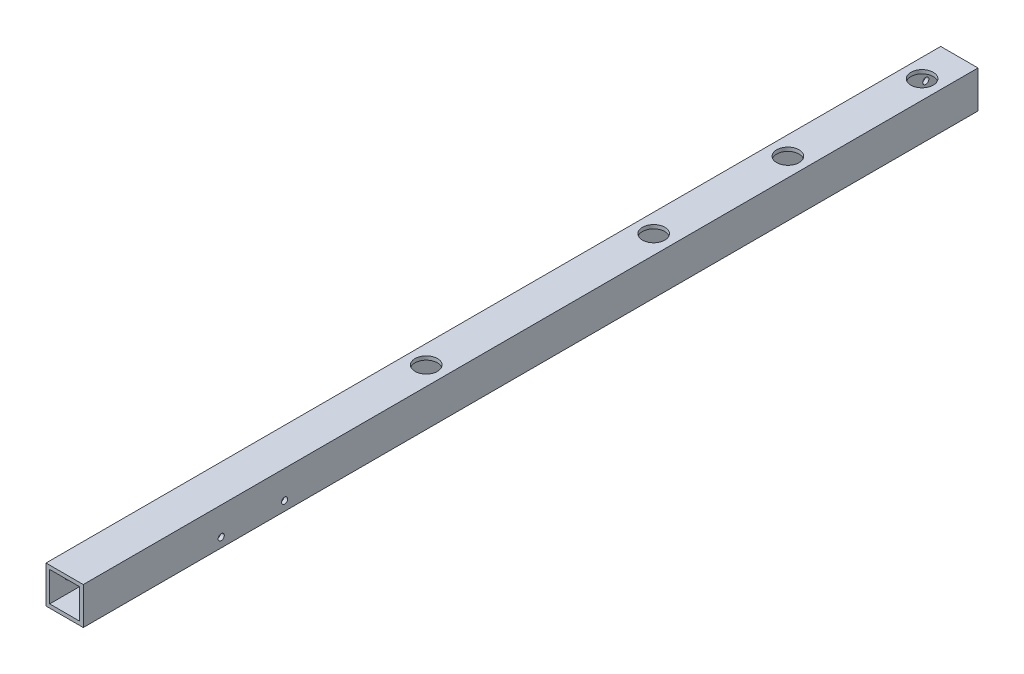
ISO-10303-21;
HEADER;
FILE_DESCRIPTION(('STEP AP214'),'2;1');
FILE_NAME('part.step','',(''),(''),'','','');
FILE_SCHEMA(('AUTOMOTIVE_DESIGN { 1 0 10303 214 1 1 1 1 }'));
ENDSEC;
DATA;
#1=APPLICATION_CONTEXT('core data for automotive mechanical design processes');
#2=APPLICATION_PROTOCOL_DEFINITION('international standard','automotive_design',2000,#1);
#3=PRODUCT_CONTEXT('',#1,'mechanical');
#4=PRODUCT('Part','Part','',(#3));
#5=PRODUCT_RELATED_PRODUCT_CATEGORY('part','',(#4));
#6=PRODUCT_DEFINITION_FORMATION('','',#4);
#7=PRODUCT_DEFINITION_CONTEXT('part definition',#1,'design');
#8=PRODUCT_DEFINITION('design','',#6,#7);
#9=PRODUCT_DEFINITION_SHAPE('','',#8);
#10=(LENGTH_UNIT() NAMED_UNIT(*) SI_UNIT(.MILLI.,.METRE.));
#11=(NAMED_UNIT(*) PLANE_ANGLE_UNIT() SI_UNIT($,.RADIAN.));
#12=(NAMED_UNIT(*) SI_UNIT($,.STERADIAN.) SOLID_ANGLE_UNIT());
#13=UNCERTAINTY_MEASURE_WITH_UNIT(LENGTH_MEASURE(1.E-05),#10,'distance_accuracy_value','');
#14=(GEOMETRIC_REPRESENTATION_CONTEXT(3) GLOBAL_UNCERTAINTY_ASSIGNED_CONTEXT((#13)) GLOBAL_UNIT_ASSIGNED_CONTEXT((#10,
#11,#12)) REPRESENTATION_CONTEXT('',''));
#15=CARTESIAN_POINT('',(0.,0.,0.));
#16=DIRECTION('',(0.,0.,1.));
#17=DIRECTION('',(1.,0.,0.));
#18=AXIS2_PLACEMENT_3D('',#15,#16,#17);
#19=CARTESIAN_POINT('',(10.,10.,560.));
#20=DIRECTION('',(-1.,0.,0.));
#21=DIRECTION('',(0.,0.,1.));
#22=AXIS2_PLACEMENT_3D('',#19,#20,#21);
#23=PLANE('',#22);
#24=CARTESIAN_POINT('',(10.,-5.,446.));
#25=DIRECTION('',(1.,0.,0.));
#26=DIRECTION('',(0.,0.,-1.));
#27=AXIS2_PLACEMENT_3D('',#24,#25,#26);
#28=CIRCLE('',#27,1.64999999999999);
#29=CARTESIAN_POINT('',(10.,-5.,444.35));
#30=VERTEX_POINT('',#29);
#31=EDGE_CURVE('E185',#30,#30,#28,.T.);
#32=ORIENTED_EDGE('',*,*,#31,.F.);
#33=EDGE_LOOP('',(#32));
#34=FACE_BOUND('',#33,.T.);
#35=DIRECTION('',(0.,0.,-1.));
#36=VECTOR('',#35,1.);
#37=CARTESIAN_POINT('',(10.,10.,560.));
#38=LINE('',#37,#36);
#39=CARTESIAN_POINT('',(10.,10.,520.));
#40=VERTEX_POINT('',#39);
#41=CARTESIAN_POINT('',(10.,10.,40.));
#42=VERTEX_POINT('',#41);
#43=EDGE_CURVE('E132',#40,#42,#38,.T.);
#44=ORIENTED_EDGE('',*,*,#43,.F.);
#45=DIRECTION('',(0.,-1.,0.));
#46=VECTOR('',#45,1.);
#47=CARTESIAN_POINT('',(10.,10.,520.));
#48=LINE('',#47,#46);
#49=CARTESIAN_POINT('',(10.,-10.,520.));
#50=VERTEX_POINT('',#49);
#51=EDGE_CURVE('E226',#40,#50,#48,.T.);
#52=ORIENTED_EDGE('',*,*,#51,.T.);
#53=DIRECTION('',(0.,0.,-1.));
#54=VECTOR('',#53,1.);
#55=CARTESIAN_POINT('',(10.,-10.,560.));
#56=LINE('',#55,#54);
#57=CARTESIAN_POINT('',(10.,-10.,40.));
#58=VERTEX_POINT('',#57);
#59=EDGE_CURVE('E126',#50,#58,#56,.T.);
#60=ORIENTED_EDGE('',*,*,#59,.T.);
#61=DIRECTION('',(0.,-1.,0.));
#62=VECTOR('',#61,1.);
#63=CARTESIAN_POINT('',(10.,10.,40.));
#64=LINE('',#63,#62);
#65=EDGE_CURVE('E121',#42,#58,#64,.T.);
#66=ORIENTED_EDGE('',*,*,#65,.F.);
#67=EDGE_LOOP('',(#44,#52,#60,#66));
#68=FACE_BOUND('',#67,.T.);
#69=CARTESIAN_POINT('',(10.,-5.,412.));
#70=DIRECTION('',(1.,0.,0.));
#71=DIRECTION('',(0.,0.,-1.));
#72=AXIS2_PLACEMENT_3D('',#69,#70,#71);
#73=CIRCLE('',#72,1.64999999999999);
#74=CARTESIAN_POINT('',(10.,-5.,410.35));
#75=VERTEX_POINT('',#74);
#76=EDGE_CURVE('E175',#75,#75,#73,.T.);
#77=ORIENTED_EDGE('',*,*,#76,.F.);
#78=EDGE_LOOP('',(#77));
#79=FACE_BOUND('',#78,.T.);
#80=ADVANCED_FACE('F35',(#34,#68,#79),#23,.F.);
#81=CARTESIAN_POINT('',(-10.,10.,560.));
#82=DIRECTION('',(1.,0.,0.));
#83=DIRECTION('',(0.,1.,0.));
#84=AXIS2_PLACEMENT_3D('',#81,#82,#83);
#85=PLANE('',#84);
#86=CARTESIAN_POINT('',(-10.,0.,490.));
#87=DIRECTION('',(1.,0.,0.));
#88=DIRECTION('',(0.,1.,0.));
#89=AXIS2_PLACEMENT_3D('',#86,#87,#88);
#90=CIRCLE('',#89,1.64999999999999);
#91=CARTESIAN_POINT('',(-10.,1.64999999999999,490.));
#92=VERTEX_POINT('',#91);
#93=EDGE_CURVE('E169',#92,#92,#90,.T.);
#94=ORIENTED_EDGE('',*,*,#93,.T.);
#95=EDGE_LOOP('',(#94));
#96=FACE_BOUND('',#95,.T.);
#97=DIRECTION('',(0.,0.,-1.));
#98=VECTOR('',#97,1.);
#99=CARTESIAN_POINT('',(-10.,-10.,560.));
#100=LINE('',#99,#98);
#101=CARTESIAN_POINT('',(-10.,-10.,520.));
#102=VERTEX_POINT('',#101);
#103=CARTESIAN_POINT('',(-10.,-10.,40.));
#104=VERTEX_POINT('',#103);
#105=EDGE_CURVE('E128',#102,#104,#100,.T.);
#106=ORIENTED_EDGE('',*,*,#105,.F.);
#107=DIRECTION('',(0.,1.,0.));
#108=VECTOR('',#107,1.);
#109=CARTESIAN_POINT('',(-10.,10.,520.));
#110=LINE('',#109,#108);
#111=CARTESIAN_POINT('',(-10.,10.,520.));
#112=VERTEX_POINT('',#111);
#113=EDGE_CURVE('E51',#102,#112,#110,.T.);
#114=ORIENTED_EDGE('',*,*,#113,.T.);
#115=DIRECTION('',(0.,0.,-1.));
#116=VECTOR('',#115,1.);
#117=CARTESIAN_POINT('',(-10.,10.,560.));
#118=LINE('',#117,#116);
#119=CARTESIAN_POINT('',(-10.,10.,40.));
#120=VERTEX_POINT('',#119);
#121=EDGE_CURVE('E130',#112,#120,#118,.T.);
#122=ORIENTED_EDGE('',*,*,#121,.T.);
#123=DIRECTION('',(0.,1.,0.));
#124=VECTOR('',#123,1.);
#125=CARTESIAN_POINT('',(-10.,10.,40.));
#126=LINE('',#125,#124);
#127=EDGE_CURVE('E240',#104,#120,#126,.T.);
#128=ORIENTED_EDGE('',*,*,#127,.F.);
#129=EDGE_LOOP('',(#106,#114,#122,#128));
#130=FACE_BOUND('',#129,.T.);
#131=CARTESIAN_POINT('',(-10.,0.,50.));
#132=DIRECTION('',(-1.,0.,0.));
#133=DIRECTION('',(0.,0.,1.));
#134=AXIS2_PLACEMENT_3D('',#131,#132,#133);
#135=CIRCLE('',#134,1.64999999999999);
#136=CARTESIAN_POINT('',(-10.,0.,51.65));
#137=VERTEX_POINT('',#136);
#138=EDGE_CURVE('E167',#137,#137,#135,.T.);
#139=ORIENTED_EDGE('',*,*,#138,.F.);
#140=EDGE_LOOP('',(#139));
#141=FACE_BOUND('',#140,.T.);
#142=CARTESIAN_POINT('',(-10.,0.,70.));
#143=DIRECTION('',(-1.,0.,0.));
#144=DIRECTION('',(0.,0.,1.));
#145=AXIS2_PLACEMENT_3D('',#142,#143,#144);
#146=CIRCLE('',#145,1.64999999999999);
#147=CARTESIAN_POINT('',(-10.,0.,71.65));
#148=VERTEX_POINT('',#147);
#149=EDGE_CURVE('E168',#148,#148,#146,.T.);
#150=ORIENTED_EDGE('',*,*,#149,.F.);
#151=EDGE_LOOP('',(#150));
#152=FACE_BOUND('',#151,.T.);
#153=CARTESIAN_POINT('',(-10.,0.,510.));
#154=DIRECTION('',(-1.,0.,0.));
#155=DIRECTION('',(0.,0.,1.));
#156=AXIS2_PLACEMENT_3D('',#153,#154,#155);
#157=CIRCLE('',#156,1.64999999999999);
#158=CARTESIAN_POINT('',(-10.,0.,511.65));
#159=VERTEX_POINT('',#158);
#160=EDGE_CURVE('E171',#159,#159,#157,.T.);
#161=ORIENTED_EDGE('',*,*,#160,.F.);
#162=EDGE_LOOP('',(#161));
#163=FACE_BOUND('',#162,.T.);
#164=ADVANCED_FACE('F259',(#96,#130,#141,#152,#163),#85,.F.);
#165=CARTESIAN_POINT('',(-10.,10.,560.));
#166=DIRECTION('',(0.,-1.,0.));
#167=DIRECTION('',(1.,0.,0.));
#168=AXIS2_PLACEMENT_3D('',#165,#166,#167);
#169=PLANE('',#168);
#170=CARTESIAN_POINT('',(0.,10.,326.));
#171=DIRECTION('',(0.,1.,0.));
#172=DIRECTION('',(-1.,0.,0.));
#173=AXIS2_PLACEMENT_3D('',#170,#171,#172);
#174=CIRCLE('',#173,6.);
#175=CARTESIAN_POINT('',(-6.,10.,326.));
#176=VERTEX_POINT('',#175);
#177=EDGE_CURVE('E163',#176,#176,#174,.T.);
#178=ORIENTED_EDGE('',*,*,#177,.F.);
#179=EDGE_LOOP('',(#178));
#180=FACE_BOUND('',#179,.T.);
#181=CARTESIAN_POINT('',(0.,10.,60.));
#182=DIRECTION('',(0.,1.,0.));
#183=DIRECTION('',(-1.,0.,0.));
#184=AXIS2_PLACEMENT_3D('',#181,#182,#183);
#185=CIRCLE('',#184,6.);
#186=CARTESIAN_POINT('',(-6.,10.,60.));
#187=VERTEX_POINT('',#186);
#188=EDGE_CURVE('E148',#187,#187,#185,.T.);
#189=ORIENTED_EDGE('',*,*,#188,.F.);
#190=EDGE_LOOP('',(#189));
#191=FACE_BOUND('',#190,.T.);
#192=CARTESIAN_POINT('',(0.,10.,132.));
#193=DIRECTION('',(0.,1.,0.));
#194=DIRECTION('',(-1.,0.,0.));
#195=AXIS2_PLACEMENT_3D('',#192,#193,#194);
#196=CIRCLE('',#195,6.);
#197=CARTESIAN_POINT('',(-5.99999999999999,10.,132.));
#198=VERTEX_POINT('',#197);
#199=EDGE_CURVE('E206',#198,#198,#196,.T.);
#200=ORIENTED_EDGE('',*,*,#199,.F.);
#201=EDGE_LOOP('',(#200));
#202=FACE_BOUND('',#201,.T.);
#203=CARTESIAN_POINT('',(0.,10.,204.));
#204=DIRECTION('',(0.,1.,0.));
#205=DIRECTION('',(-1.,0.,0.));
#206=AXIS2_PLACEMENT_3D('',#203,#204,#205);
#207=CIRCLE('',#206,6.);
#208=CARTESIAN_POINT('',(-5.99999999999999,10.,204.));
#209=VERTEX_POINT('',#208);
#210=EDGE_CURVE('E158',#209,#209,#207,.T.);
#211=ORIENTED_EDGE('',*,*,#210,.F.);
#212=EDGE_LOOP('',(#211));
#213=FACE_BOUND('',#212,.T.);
#214=ORIENTED_EDGE('',*,*,#121,.F.);
#215=DIRECTION('',(1.,0.,0.));
#216=VECTOR('',#215,1.);
#217=CARTESIAN_POINT('',(-10.,10.,520.));
#218=LINE('',#217,#216);
#219=EDGE_CURVE('E223',#112,#40,#218,.T.);
#220=ORIENTED_EDGE('',*,*,#219,.T.);
#221=ORIENTED_EDGE('',*,*,#43,.T.);
#222=DIRECTION('',(1.,0.,0.));
#223=VECTOR('',#222,1.);
#224=CARTESIAN_POINT('',(-10.,10.,40.));
#225=LINE('',#224,#223);
#226=EDGE_CURVE('E243',#120,#42,#225,.T.);
#227=ORIENTED_EDGE('',*,*,#226,.F.);
#228=EDGE_LOOP('',(#214,#220,#221,#227));
#229=FACE_BOUND('',#228,.T.);
#230=ADVANCED_FACE('F263',(#180,#191,#202,#213,#229),#169,.F.);
#231=CARTESIAN_POINT('',(-10.,-10.,560.));
#232=DIRECTION('',(0.,1.,0.));
#233=DIRECTION('',(0.,0.,1.));
#234=AXIS2_PLACEMENT_3D('',#231,#232,#233);
#235=PLANE('',#234);
#236=CARTESIAN_POINT('',(0.,-10.,326.));
#237=DIRECTION('',(0.,1.,0.));
#238=DIRECTION('',(-1.,0.,0.));
#239=AXIS2_PLACEMENT_3D('',#236,#237,#238);
#240=CIRCLE('',#239,2.1);
#241=CARTESIAN_POINT('',(-2.1,-10.,326.));
#242=VERTEX_POINT('',#241);
#243=EDGE_CURVE('E159',#242,#242,#240,.T.);
#244=ORIENTED_EDGE('',*,*,#243,.T.);
#245=EDGE_LOOP('',(#244));
#246=FACE_BOUND('',#245,.T.);
#247=CARTESIAN_POINT('',(0.,-10.,60.));
#248=DIRECTION('',(0.,1.,0.));
#249=DIRECTION('',(-1.,0.,0.));
#250=AXIS2_PLACEMENT_3D('',#247,#248,#249);
#251=CIRCLE('',#250,2.1);
#252=CARTESIAN_POINT('',(-2.1,-10.,60.));
#253=VERTEX_POINT('',#252);
#254=EDGE_CURVE('E139',#253,#253,#251,.T.);
#255=ORIENTED_EDGE('',*,*,#254,.T.);
#256=EDGE_LOOP('',(#255));
#257=FACE_BOUND('',#256,.T.);
#258=CARTESIAN_POINT('',(0.,-10.,132.));
#259=DIRECTION('',(0.,1.,0.));
#260=DIRECTION('',(-1.,0.,0.));
#261=AXIS2_PLACEMENT_3D('',#258,#259,#260);
#262=CIRCLE('',#261,2.1);
#263=CARTESIAN_POINT('',(-2.09999999999999,-10.,132.));
#264=VERTEX_POINT('',#263);
#265=EDGE_CURVE('E213',#264,#264,#262,.T.);
#266=ORIENTED_EDGE('',*,*,#265,.T.);
#267=EDGE_LOOP('',(#266));
#268=FACE_BOUND('',#267,.T.);
#269=CARTESIAN_POINT('',(0.,-10.,204.));
#270=DIRECTION('',(0.,1.,0.));
#271=DIRECTION('',(-1.,0.,0.));
#272=AXIS2_PLACEMENT_3D('',#269,#270,#271);
#273=CIRCLE('',#272,2.1);
#274=CARTESIAN_POINT('',(-2.09999999999999,-10.,204.));
#275=VERTEX_POINT('',#274);
#276=EDGE_CURVE('E154',#275,#275,#273,.T.);
#277=ORIENTED_EDGE('',*,*,#276,.T.);
#278=EDGE_LOOP('',(#277));
#279=FACE_BOUND('',#278,.T.);
#280=ORIENTED_EDGE('',*,*,#59,.F.);
#281=DIRECTION('',(-1.,0.,0.));
#282=VECTOR('',#281,1.);
#283=CARTESIAN_POINT('',(-10.,-10.,520.));
#284=LINE('',#283,#282);
#285=EDGE_CURVE('E220',#50,#102,#284,.T.);
#286=ORIENTED_EDGE('',*,*,#285,.T.);
#287=ORIENTED_EDGE('',*,*,#105,.T.);
#288=DIRECTION('',(-1.,0.,0.));
#289=VECTOR('',#288,1.);
#290=CARTESIAN_POINT('',(-10.,-10.,40.));
#291=LINE('',#290,#289);
#292=EDGE_CURVE('E237',#58,#104,#291,.T.);
#293=ORIENTED_EDGE('',*,*,#292,.F.);
#294=EDGE_LOOP('',(#280,#286,#287,#293));
#295=FACE_BOUND('',#294,.T.);
#296=ADVANCED_FACE('F256',(#246,#257,#268,#279,#295),#235,.F.);
#297=CARTESIAN_POINT('',(8.,8.,560.));
#298=DIRECTION('',(-1.,0.,0.));
#299=DIRECTION('',(0.,0.,1.));
#300=AXIS2_PLACEMENT_3D('',#297,#298,#299);
#301=PLANE('',#300);
#302=CARTESIAN_POINT('',(8.,-5.,446.));
#303=DIRECTION('',(-1.,0.,0.));
#304=DIRECTION('',(0.,0.,1.));
#305=AXIS2_PLACEMENT_3D('',#302,#303,#304);
#306=CIRCLE('',#305,1.64999999999999);
#307=CARTESIAN_POINT('',(8.,-5.,447.65));
#308=VERTEX_POINT('',#307);
#309=EDGE_CURVE('E38',#308,#308,#306,.T.);
#310=ORIENTED_EDGE('',*,*,#309,.F.);
#311=EDGE_LOOP('',(#310));
#312=FACE_BOUND('',#311,.T.);
#313=CARTESIAN_POINT('',(8.,-5.,412.));
#314=DIRECTION('',(-1.,0.,0.));
#315=DIRECTION('',(0.,0.,1.));
#316=AXIS2_PLACEMENT_3D('',#313,#314,#315);
#317=CIRCLE('',#316,1.64999999999999);
#318=CARTESIAN_POINT('',(8.,-5.,413.65));
#319=VERTEX_POINT('',#318);
#320=EDGE_CURVE('E173',#319,#319,#317,.T.);
#321=ORIENTED_EDGE('',*,*,#320,.F.);
#322=EDGE_LOOP('',(#321));
#323=FACE_BOUND('',#322,.T.);
#324=DIRECTION('',(0.,-1.,0.));
#325=VECTOR('',#324,1.);
#326=CARTESIAN_POINT('',(8.,8.,520.));
#327=LINE('',#326,#325);
#328=CARTESIAN_POINT('',(8.,8.,520.));
#329=VERTEX_POINT('',#328);
#330=CARTESIAN_POINT('',(8.,-8.,520.));
#331=VERTEX_POINT('',#330);
#332=EDGE_CURVE('E58',#329,#331,#327,.T.);
#333=ORIENTED_EDGE('',*,*,#332,.F.);
#334=DIRECTION('',(0.,0.,-1.));
#335=VECTOR('',#334,1.);
#336=CARTESIAN_POINT('',(8.,8.,560.));
#337=LINE('',#336,#335);
#338=CARTESIAN_POINT('',(8.,8.,40.));
#339=VERTEX_POINT('',#338);
#340=EDGE_CURVE('E119',#329,#339,#337,.T.);
#341=ORIENTED_EDGE('',*,*,#340,.T.);
#342=DIRECTION('',(0.,-1.,0.));
#343=VECTOR('',#342,1.);
#344=CARTESIAN_POINT('',(8.,8.,40.));
#345=LINE('',#344,#343);
#346=CARTESIAN_POINT('',(8.,-8.,40.));
#347=VERTEX_POINT('',#346);
#348=EDGE_CURVE('E234',#339,#347,#345,.T.);
#349=ORIENTED_EDGE('',*,*,#348,.T.);
#350=DIRECTION('',(0.,0.,-1.));
#351=VECTOR('',#350,1.);
#352=CARTESIAN_POINT('',(8.,-8.,560.));
#353=LINE('',#352,#351);
#354=EDGE_CURVE('E117',#331,#347,#353,.T.);
#355=ORIENTED_EDGE('',*,*,#354,.F.);
#356=EDGE_LOOP('',(#333,#341,#349,#355));
#357=FACE_BOUND('',#356,.T.);
#358=ADVANCED_FACE('F347',(#312,#323,#357),#301,.T.);
#359=CARTESIAN_POINT('',(-8.,8.,560.));
#360=DIRECTION('',(0.,-1.,0.));
#361=DIRECTION('',(0.,0.,-1.));
#362=AXIS2_PLACEMENT_3D('',#359,#360,#361);
#363=PLANE('',#362);
#364=CARTESIAN_POINT('',(0.,8.,326.));
#365=DIRECTION('',(0.,-1.,0.));
#366=DIRECTION('',(0.,0.,-1.));
#367=AXIS2_PLACEMENT_3D('',#364,#365,#366);
#368=CIRCLE('',#367,6.);
#369=CARTESIAN_POINT('',(0.,8.,320.));
#370=VERTEX_POINT('',#369);
#371=EDGE_CURVE('E160',#370,#370,#368,.T.);
#372=ORIENTED_EDGE('',*,*,#371,.F.);
#373=EDGE_LOOP('',(#372));
#374=FACE_BOUND('',#373,.T.);
#375=CARTESIAN_POINT('',(0.,8.,60.));
#376=DIRECTION('',(0.,-1.,0.));
#377=DIRECTION('',(0.,0.,-1.));
#378=AXIS2_PLACEMENT_3D('',#375,#376,#377);
#379=CIRCLE('',#378,6.);
#380=CARTESIAN_POINT('',(0.,8.,54.));
#381=VERTEX_POINT('',#380);
#382=EDGE_CURVE('E151',#381,#381,#379,.T.);
#383=ORIENTED_EDGE('',*,*,#382,.F.);
#384=EDGE_LOOP('',(#383));
#385=FACE_BOUND('',#384,.T.);
#386=CARTESIAN_POINT('',(0.,8.,132.));
#387=DIRECTION('',(0.,-1.,0.));
#388=DIRECTION('',(0.,0.,-1.));
#389=AXIS2_PLACEMENT_3D('',#386,#387,#388);
#390=CIRCLE('',#389,6.);
#391=CARTESIAN_POINT('',(0.,8.,126.));
#392=VERTEX_POINT('',#391);
#393=EDGE_CURVE('E147',#392,#392,#390,.T.);
#394=ORIENTED_EDGE('',*,*,#393,.F.);
#395=EDGE_LOOP('',(#394));
#396=FACE_BOUND('',#395,.T.);
#397=CARTESIAN_POINT('',(0.,8.,204.));
#398=DIRECTION('',(0.,-1.,0.));
#399=DIRECTION('',(0.,0.,-1.));
#400=AXIS2_PLACEMENT_3D('',#397,#398,#399);
#401=CIRCLE('',#400,6.);
#402=CARTESIAN_POINT('',(0.,8.,198.));
#403=VERTEX_POINT('',#402);
#404=EDGE_CURVE('E144',#403,#403,#401,.T.);
#405=ORIENTED_EDGE('',*,*,#404,.F.);
#406=EDGE_LOOP('',(#405));
#407=FACE_BOUND('',#406,.T.);
#408=DIRECTION('',(1.,0.,0.));
#409=VECTOR('',#408,1.);
#410=CARTESIAN_POINT('',(-8.,8.,520.));
#411=LINE('',#410,#409);
#412=CARTESIAN_POINT('',(-8.,8.,520.));
#413=VERTEX_POINT('',#412);
#414=EDGE_CURVE('E111',#413,#329,#411,.T.);
#415=ORIENTED_EDGE('',*,*,#414,.F.);
#416=DIRECTION('',(0.,0.,-1.));
#417=VECTOR('',#416,1.);
#418=CARTESIAN_POINT('',(-8.,8.,560.));
#419=LINE('',#418,#417);
#420=CARTESIAN_POINT('',(-8.,8.,40.));
#421=VERTEX_POINT('',#420);
#422=EDGE_CURVE('E110',#413,#421,#419,.T.);
#423=ORIENTED_EDGE('',*,*,#422,.T.);
#424=DIRECTION('',(1.,0.,0.));
#425=VECTOR('',#424,1.);
#426=CARTESIAN_POINT('',(-8.,8.,40.));
#427=LINE('',#426,#425);
#428=EDGE_CURVE('E231',#421,#339,#427,.T.);
#429=ORIENTED_EDGE('',*,*,#428,.T.);
#430=ORIENTED_EDGE('',*,*,#340,.F.);
#431=EDGE_LOOP('',(#415,#423,#429,#430));
#432=FACE_BOUND('',#431,.T.);
#433=ADVANCED_FACE('F356',(#374,#385,#396,#407,#432),#363,.T.);
#434=CARTESIAN_POINT('',(-8.,8.,560.));
#435=DIRECTION('',(1.,0.,0.));
#436=DIRECTION('',(0.,0.,-1.));
#437=AXIS2_PLACEMENT_3D('',#434,#435,#436);
#438=PLANE('',#437);
#439=CARTESIAN_POINT('',(-8.,0.,490.));
#440=DIRECTION('',(1.,0.,0.));
#441=DIRECTION('',(0.,0.,-1.));
#442=AXIS2_PLACEMENT_3D('',#439,#440,#441);
#443=CIRCLE('',#442,1.64999999999999);
#444=CARTESIAN_POINT('',(-8.,0.,488.35));
#445=VERTEX_POINT('',#444);
#446=EDGE_CURVE('E172',#445,#445,#443,.T.);
#447=ORIENTED_EDGE('',*,*,#446,.F.);
#448=EDGE_LOOP('',(#447));
#449=FACE_BOUND('',#448,.T.);
#450=CARTESIAN_POINT('',(-8.,0.,510.));
#451=DIRECTION('',(1.,0.,0.));
#452=DIRECTION('',(0.,0.,-1.));
#453=AXIS2_PLACEMENT_3D('',#450,#451,#452);
#454=CIRCLE('',#453,1.64999999999999);
#455=CARTESIAN_POINT('',(-8.,0.,508.35));
#456=VERTEX_POINT('',#455);
#457=EDGE_CURVE('E190',#456,#456,#454,.T.);
#458=ORIENTED_EDGE('',*,*,#457,.F.);
#459=EDGE_LOOP('',(#458));
#460=FACE_BOUND('',#459,.T.);
#461=CARTESIAN_POINT('',(-8.,0.,70.));
#462=DIRECTION('',(1.,0.,0.));
#463=DIRECTION('',(0.,0.,-1.));
#464=AXIS2_PLACEMENT_3D('',#461,#462,#463);
#465=CIRCLE('',#464,1.64999999999999);
#466=CARTESIAN_POINT('',(-8.,0.,68.35));
#467=VERTEX_POINT('',#466);
#468=EDGE_CURVE('E164',#467,#467,#465,.T.);
#469=ORIENTED_EDGE('',*,*,#468,.F.);
#470=EDGE_LOOP('',(#469));
#471=FACE_BOUND('',#470,.T.);
#472=CARTESIAN_POINT('',(-8.,0.,50.));
#473=DIRECTION('',(1.,0.,0.));
#474=DIRECTION('',(0.,0.,-1.));
#475=AXIS2_PLACEMENT_3D('',#472,#473,#474);
#476=CIRCLE('',#475,1.64999999999999);
#477=CARTESIAN_POINT('',(-8.,0.,48.35));
#478=VERTEX_POINT('',#477);
#479=EDGE_CURVE('E197',#478,#478,#476,.T.);
#480=ORIENTED_EDGE('',*,*,#479,.F.);
#481=EDGE_LOOP('',(#480));
#482=FACE_BOUND('',#481,.T.);
#483=DIRECTION('',(0.,1.,0.));
#484=VECTOR('',#483,1.);
#485=CARTESIAN_POINT('',(-8.,8.,520.));
#486=LINE('',#485,#484);
#487=CARTESIAN_POINT('',(-8.,-8.,520.));
#488=VERTEX_POINT('',#487);
#489=EDGE_CURVE('E99',#488,#413,#486,.T.);
#490=ORIENTED_EDGE('',*,*,#489,.F.);
#491=DIRECTION('',(0.,0.,-1.));
#492=VECTOR('',#491,1.);
#493=CARTESIAN_POINT('',(-8.,-8.,560.));
#494=LINE('',#493,#492);
#495=CARTESIAN_POINT('',(-8.,-8.,40.));
#496=VERTEX_POINT('',#495);
#497=EDGE_CURVE('E108',#488,#496,#494,.T.);
#498=ORIENTED_EDGE('',*,*,#497,.T.);
#499=DIRECTION('',(0.,1.,0.));
#500=VECTOR('',#499,1.);
#501=CARTESIAN_POINT('',(-8.,8.,40.));
#502=LINE('',#501,#500);
#503=EDGE_CURVE('E229',#496,#421,#502,.T.);
#504=ORIENTED_EDGE('',*,*,#503,.T.);
#505=ORIENTED_EDGE('',*,*,#422,.F.);
#506=EDGE_LOOP('',(#490,#498,#504,#505));
#507=FACE_BOUND('',#506,.T.);
#508=ADVANCED_FACE('F106',(#449,#460,#471,#482,#507),#438,.T.);
#509=CARTESIAN_POINT('',(-8.,-8.,560.));
#510=DIRECTION('',(0.,1.,0.));
#511=DIRECTION('',(0.,0.,1.));
#512=AXIS2_PLACEMENT_3D('',#509,#510,#511);
#513=PLANE('',#512);
#514=CARTESIAN_POINT('',(0.,-8.,326.));
#515=DIRECTION('',(0.,1.,0.));
#516=DIRECTION('',(0.,0.,1.));
#517=AXIS2_PLACEMENT_3D('',#514,#515,#516);
#518=CIRCLE('',#517,2.1);
#519=CARTESIAN_POINT('',(0.,-8.,328.1));
#520=VERTEX_POINT('',#519);
#521=EDGE_CURVE('E155',#520,#520,#518,.T.);
#522=ORIENTED_EDGE('',*,*,#521,.F.);
#523=EDGE_LOOP('',(#522));
#524=FACE_BOUND('',#523,.T.);
#525=CARTESIAN_POINT('',(0.,-8.,60.));
#526=DIRECTION('',(0.,1.,0.));
#527=DIRECTION('',(0.,0.,1.));
#528=AXIS2_PLACEMENT_3D('',#525,#526,#527);
#529=CIRCLE('',#528,2.1);
#530=CARTESIAN_POINT('',(0.,-8.,62.1));
#531=VERTEX_POINT('',#530);
#532=EDGE_CURVE('E112',#531,#531,#529,.T.);
#533=ORIENTED_EDGE('',*,*,#532,.F.);
#534=EDGE_LOOP('',(#533));
#535=FACE_BOUND('',#534,.T.);
#536=CARTESIAN_POINT('',(0.,-8.,132.));
#537=DIRECTION('',(0.,1.,0.));
#538=DIRECTION('',(0.,0.,1.));
#539=AXIS2_PLACEMENT_3D('',#536,#537,#538);
#540=CIRCLE('',#539,2.1);
#541=CARTESIAN_POINT('',(0.,-8.,134.1));
#542=VERTEX_POINT('',#541);
#543=EDGE_CURVE('E138',#542,#542,#540,.T.);
#544=ORIENTED_EDGE('',*,*,#543,.F.);
#545=EDGE_LOOP('',(#544));
#546=FACE_BOUND('',#545,.T.);
#547=CARTESIAN_POINT('',(0.,-8.,204.));
#548=DIRECTION('',(0.,1.,0.));
#549=DIRECTION('',(0.,0.,1.));
#550=AXIS2_PLACEMENT_3D('',#547,#548,#549);
#551=CIRCLE('',#550,2.1);
#552=CARTESIAN_POINT('',(0.,-8.,206.1));
#553=VERTEX_POINT('',#552);
#554=EDGE_CURVE('E135',#553,#553,#551,.T.);
#555=ORIENTED_EDGE('',*,*,#554,.F.);
#556=EDGE_LOOP('',(#555));
#557=FACE_BOUND('',#556,.T.);
#558=DIRECTION('',(-1.,0.,0.));
#559=VECTOR('',#558,1.);
#560=CARTESIAN_POINT('',(-8.,-8.,520.));
#561=LINE('',#560,#559);
#562=EDGE_CURVE('E11',#331,#488,#561,.T.);
#563=ORIENTED_EDGE('',*,*,#562,.F.);
#564=ORIENTED_EDGE('',*,*,#354,.T.);
#565=DIRECTION('',(-1.,0.,0.));
#566=VECTOR('',#565,1.);
#567=CARTESIAN_POINT('',(-8.,-8.,40.));
#568=LINE('',#567,#566);
#569=EDGE_CURVE('E43',#347,#496,#568,.T.);
#570=ORIENTED_EDGE('',*,*,#569,.T.);
#571=ORIENTED_EDGE('',*,*,#497,.F.);
#572=EDGE_LOOP('',(#563,#564,#570,#571));
#573=FACE_BOUND('',#572,.T.);
#574=ADVANCED_FACE('F115',(#524,#535,#546,#557,#573),#513,.T.);
#575=CARTESIAN_POINT('',(0.,0.,40.));
#576=DIRECTION('',(0.,0.,-1.));
#577=DIRECTION('',(-1.,0.,0.));
#578=AXIS2_PLACEMENT_3D('',#575,#576,#577);
#579=PLANE('',#578);
#580=ORIENTED_EDGE('',*,*,#428,.F.);
#581=ORIENTED_EDGE('',*,*,#503,.F.);
#582=ORIENTED_EDGE('',*,*,#569,.F.);
#583=ORIENTED_EDGE('',*,*,#348,.F.);
#584=EDGE_LOOP('',(#580,#581,#582,#583));
#585=FACE_BOUND('',#584,.T.);
#586=ORIENTED_EDGE('',*,*,#65,.T.);
#587=ORIENTED_EDGE('',*,*,#292,.T.);
#588=ORIENTED_EDGE('',*,*,#127,.T.);
#589=ORIENTED_EDGE('',*,*,#226,.T.);
#590=EDGE_LOOP('',(#586,#587,#588,#589));
#591=FACE_BOUND('',#590,.T.);
#592=ADVANCED_FACE('F249',(#585,#591),#579,.T.);
#593=CARTESIAN_POINT('',(0.,0.,520.));
#594=DIRECTION('',(0.,0.,-1.));
#595=DIRECTION('',(-1.,0.,0.));
#596=AXIS2_PLACEMENT_3D('',#593,#594,#595);
#597=PLANE('',#596);
#598=ORIENTED_EDGE('',*,*,#332,.T.);
#599=ORIENTED_EDGE('',*,*,#562,.T.);
#600=ORIENTED_EDGE('',*,*,#489,.T.);
#601=ORIENTED_EDGE('',*,*,#414,.T.);
#602=EDGE_LOOP('',(#598,#599,#600,#601));
#603=FACE_BOUND('',#602,.T.);
#604=ORIENTED_EDGE('',*,*,#219,.F.);
#605=ORIENTED_EDGE('',*,*,#113,.F.);
#606=ORIENTED_EDGE('',*,*,#285,.F.);
#607=ORIENTED_EDGE('',*,*,#51,.F.);
#608=EDGE_LOOP('',(#604,#605,#606,#607));
#609=FACE_BOUND('',#608,.T.);
#610=ADVANCED_FACE('F98',(#603,#609),#597,.F.);
#611=CARTESIAN_POINT('',(0.,-10.,204.));
#612=DIRECTION('',(0.,1.,0.));
#613=DIRECTION('',(-1.,0.,0.));
#614=AXIS2_PLACEMENT_3D('',#611,#612,#613);
#615=CYLINDRICAL_SURFACE('',#614,2.1);
#616=ORIENTED_EDGE('',*,*,#554,.T.);
#617=EDGE_LOOP('',(#616));
#618=FACE_BOUND('',#617,.T.);
#619=ORIENTED_EDGE('',*,*,#276,.F.);
#620=EDGE_LOOP('',(#619));
#621=FACE_BOUND('',#620,.T.);
#622=ADVANCED_FACE('F266',(#618,#621),#615,.F.);
#623=CARTESIAN_POINT('',(0.,-10.,132.));
#624=DIRECTION('',(0.,1.,0.));
#625=DIRECTION('',(-1.,0.,0.));
#626=AXIS2_PLACEMENT_3D('',#623,#624,#625);
#627=CYLINDRICAL_SURFACE('',#626,2.1);
#628=ORIENTED_EDGE('',*,*,#543,.T.);
#629=EDGE_LOOP('',(#628));
#630=FACE_BOUND('',#629,.T.);
#631=ORIENTED_EDGE('',*,*,#265,.F.);
#632=EDGE_LOOP('',(#631));
#633=FACE_BOUND('',#632,.T.);
#634=ADVANCED_FACE('F272',(#630,#633),#627,.F.);
#635=CARTESIAN_POINT('',(0.,-10.,60.));
#636=DIRECTION('',(0.,1.,0.));
#637=DIRECTION('',(-1.,0.,0.));
#638=AXIS2_PLACEMENT_3D('',#635,#636,#637);
#639=CYLINDRICAL_SURFACE('',#638,2.1);
#640=ORIENTED_EDGE('',*,*,#532,.T.);
#641=EDGE_LOOP('',(#640));
#642=FACE_BOUND('',#641,.T.);
#643=ORIENTED_EDGE('',*,*,#254,.F.);
#644=EDGE_LOOP('',(#643));
#645=FACE_BOUND('',#644,.T.);
#646=ADVANCED_FACE('F332',(#642,#645),#639,.F.);
#647=CARTESIAN_POINT('',(0.,0.,204.));
#648=DIRECTION('',(0.,1.,0.));
#649=DIRECTION('',(-1.,0.,0.));
#650=AXIS2_PLACEMENT_3D('',#647,#648,#649);
#651=CYLINDRICAL_SURFACE('',#650,6.);
#652=ORIENTED_EDGE('',*,*,#404,.T.);
#653=EDGE_LOOP('',(#652));
#654=FACE_BOUND('',#653,.T.);
#655=ORIENTED_EDGE('',*,*,#210,.T.);
#656=EDGE_LOOP('',(#655));
#657=FACE_BOUND('',#656,.T.);
#658=ADVANCED_FACE('F328',(#654,#657),#651,.F.);
#659=CARTESIAN_POINT('',(0.,0.,132.));
#660=DIRECTION('',(0.,1.,0.));
#661=DIRECTION('',(-1.,0.,0.));
#662=AXIS2_PLACEMENT_3D('',#659,#660,#661);
#663=CYLINDRICAL_SURFACE('',#662,6.);
#664=ORIENTED_EDGE('',*,*,#393,.T.);
#665=EDGE_LOOP('',(#664));
#666=FACE_BOUND('',#665,.T.);
#667=ORIENTED_EDGE('',*,*,#199,.T.);
#668=EDGE_LOOP('',(#667));
#669=FACE_BOUND('',#668,.T.);
#670=ADVANCED_FACE('F324',(#666,#669),#663,.F.);
#671=CARTESIAN_POINT('',(0.,0.,60.));
#672=DIRECTION('',(0.,1.,0.));
#673=DIRECTION('',(-1.,0.,0.));
#674=AXIS2_PLACEMENT_3D('',#671,#672,#673);
#675=CYLINDRICAL_SURFACE('',#674,6.);
#676=ORIENTED_EDGE('',*,*,#382,.T.);
#677=EDGE_LOOP('',(#676));
#678=FACE_BOUND('',#677,.T.);
#679=ORIENTED_EDGE('',*,*,#188,.T.);
#680=EDGE_LOOP('',(#679));
#681=FACE_BOUND('',#680,.T.);
#682=ADVANCED_FACE('F320',(#678,#681),#675,.F.);
#683=CARTESIAN_POINT('',(0.,-10.,326.));
#684=DIRECTION('',(0.,1.,0.));
#685=DIRECTION('',(-1.,0.,0.));
#686=AXIS2_PLACEMENT_3D('',#683,#684,#685);
#687=CYLINDRICAL_SURFACE('',#686,2.1);
#688=ORIENTED_EDGE('',*,*,#521,.T.);
#689=EDGE_LOOP('',(#688));
#690=FACE_BOUND('',#689,.T.);
#691=ORIENTED_EDGE('',*,*,#243,.F.);
#692=EDGE_LOOP('',(#691));
#693=FACE_BOUND('',#692,.T.);
#694=ADVANCED_FACE('F316',(#690,#693),#687,.F.);
#695=CARTESIAN_POINT('',(0.,0.,326.));
#696=DIRECTION('',(0.,1.,0.));
#697=DIRECTION('',(-1.,0.,0.));
#698=AXIS2_PLACEMENT_3D('',#695,#696,#697);
#699=CYLINDRICAL_SURFACE('',#698,6.);
#700=ORIENTED_EDGE('',*,*,#371,.T.);
#701=EDGE_LOOP('',(#700));
#702=FACE_BOUND('',#701,.T.);
#703=ORIENTED_EDGE('',*,*,#177,.T.);
#704=EDGE_LOOP('',(#703));
#705=FACE_BOUND('',#704,.T.);
#706=ADVANCED_FACE('F312',(#702,#705),#699,.F.);
#707=CARTESIAN_POINT('',(-10.,0.,50.));
#708=DIRECTION('',(-1.,0.,0.));
#709=DIRECTION('',(0.,0.,1.));
#710=AXIS2_PLACEMENT_3D('',#707,#708,#709);
#711=CYLINDRICAL_SURFACE('',#710,1.64999999999999);
#712=ORIENTED_EDGE('',*,*,#479,.T.);
#713=EDGE_LOOP('',(#712));
#714=FACE_BOUND('',#713,.T.);
#715=ORIENTED_EDGE('',*,*,#138,.T.);
#716=EDGE_LOOP('',(#715));
#717=FACE_BOUND('',#716,.T.);
#718=ADVANCED_FACE('F308',(#714,#717),#711,.F.);
#719=CARTESIAN_POINT('',(-10.,0.,70.));
#720=DIRECTION('',(-1.,0.,0.));
#721=DIRECTION('',(0.,0.,1.));
#722=AXIS2_PLACEMENT_3D('',#719,#720,#721);
#723=CYLINDRICAL_SURFACE('',#722,1.64999999999999);
#724=ORIENTED_EDGE('',*,*,#468,.T.);
#725=EDGE_LOOP('',(#724));
#726=FACE_BOUND('',#725,.T.);
#727=ORIENTED_EDGE('',*,*,#149,.T.);
#728=EDGE_LOOP('',(#727));
#729=FACE_BOUND('',#728,.T.);
#730=ADVANCED_FACE('F304',(#726,#729),#723,.F.);
#731=CARTESIAN_POINT('',(-10.,0.,510.));
#732=DIRECTION('',(-1.,0.,0.));
#733=DIRECTION('',(0.,0.,1.));
#734=AXIS2_PLACEMENT_3D('',#731,#732,#733);
#735=CYLINDRICAL_SURFACE('',#734,1.64999999999999);
#736=ORIENTED_EDGE('',*,*,#457,.T.);
#737=EDGE_LOOP('',(#736));
#738=FACE_BOUND('',#737,.T.);
#739=ORIENTED_EDGE('',*,*,#160,.T.);
#740=EDGE_LOOP('',(#739));
#741=FACE_BOUND('',#740,.T.);
#742=ADVANCED_FACE('F300',(#738,#741),#735,.F.);
#743=CARTESIAN_POINT('',(-8.,0.,490.));
#744=DIRECTION('',(1.,0.,0.));
#745=DIRECTION('',(0.,0.,-1.));
#746=AXIS2_PLACEMENT_3D('',#743,#744,#745);
#747=CYLINDRICAL_SURFACE('',#746,1.64999999999999);
#748=ORIENTED_EDGE('',*,*,#446,.T.);
#749=EDGE_LOOP('',(#748));
#750=FACE_BOUND('',#749,.T.);
#751=ORIENTED_EDGE('',*,*,#93,.F.);
#752=EDGE_LOOP('',(#751));
#753=FACE_BOUND('',#752,.T.);
#754=ADVANCED_FACE('F295',(#750,#753),#747,.F.);
#755=CARTESIAN_POINT('',(10.,-5.,412.));
#756=DIRECTION('',(1.,0.,0.));
#757=DIRECTION('',(0.,0.,-1.));
#758=AXIS2_PLACEMENT_3D('',#755,#756,#757);
#759=CYLINDRICAL_SURFACE('',#758,1.64999999999999);
#760=ORIENTED_EDGE('',*,*,#320,.T.);
#761=EDGE_LOOP('',(#760));
#762=FACE_BOUND('',#761,.T.);
#763=ORIENTED_EDGE('',*,*,#76,.T.);
#764=EDGE_LOOP('',(#763));
#765=FACE_BOUND('',#764,.T.);
#766=ADVANCED_FACE('F289',(#762,#765),#759,.F.);
#767=CARTESIAN_POINT('',(10.,-5.,446.));
#768=DIRECTION('',(1.,0.,0.));
#769=DIRECTION('',(0.,0.,-1.));
#770=AXIS2_PLACEMENT_3D('',#767,#768,#769);
#771=CYLINDRICAL_SURFACE('',#770,1.64999999999999);
#772=ORIENTED_EDGE('',*,*,#309,.T.);
#773=EDGE_LOOP('',(#772));
#774=FACE_BOUND('',#773,.T.);
#775=ORIENTED_EDGE('',*,*,#31,.T.);
#776=EDGE_LOOP('',(#775));
#777=FACE_BOUND('',#776,.T.);
#778=ADVANCED_FACE('F287',(#774,#777),#771,.F.);
#779=CLOSED_SHELL('',(#80,#164,#230,#296,#358,#433,#508,#574,#592,#610,#622,#634,#646,#658,#670,
#682,#694,#706,#718,#730,#742,#754,#766,#778));
#780=MANIFOLD_SOLID_BREP('B2',#779);
#781=ADVANCED_BREP_SHAPE_REPRESENTATION('',(#18,#780),#14);
#782=SHAPE_DEFINITION_REPRESENTATION(#9,#781);
ENDSEC;
END-ISO-10303-21;
